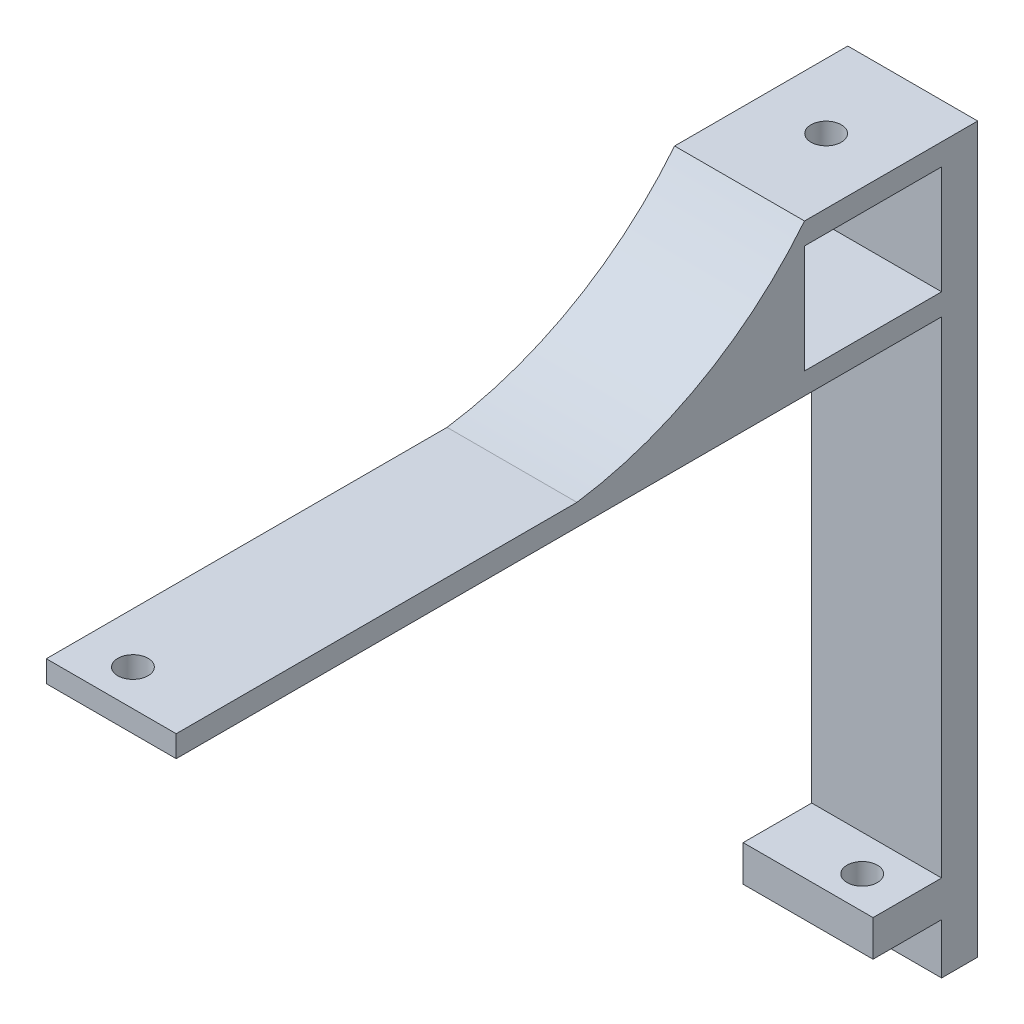
ISO-10303-21;
HEADER;
FILE_DESCRIPTION(('STEP AP214'),'2;1');
FILE_NAME('part.step','',(''),(''),'','','');
FILE_SCHEMA(('AUTOMOTIVE_DESIGN { 1 0 10303 214 1 1 1 1 }'));
ENDSEC;
DATA;
#1=APPLICATION_CONTEXT('core data for automotive mechanical design processes');
#2=APPLICATION_PROTOCOL_DEFINITION('international standard','automotive_design',2000,#1);
#3=PRODUCT_CONTEXT('',#1,'mechanical');
#4=PRODUCT('Part','Part','',(#3));
#5=PRODUCT_RELATED_PRODUCT_CATEGORY('part','',(#4));
#6=PRODUCT_DEFINITION_FORMATION('','',#4);
#7=PRODUCT_DEFINITION_CONTEXT('part definition',#1,'design');
#8=PRODUCT_DEFINITION('design','',#6,#7);
#9=PRODUCT_DEFINITION_SHAPE('','',#8);
#10=(LENGTH_UNIT() NAMED_UNIT(*) SI_UNIT(.MILLI.,.METRE.));
#11=(NAMED_UNIT(*) PLANE_ANGLE_UNIT() SI_UNIT($,.RADIAN.));
#12=(NAMED_UNIT(*) SI_UNIT($,.STERADIAN.) SOLID_ANGLE_UNIT());
#13=UNCERTAINTY_MEASURE_WITH_UNIT(LENGTH_MEASURE(1.E-05),#10,'distance_accuracy_value','');
#14=(GEOMETRIC_REPRESENTATION_CONTEXT(3) GLOBAL_UNCERTAINTY_ASSIGNED_CONTEXT((#13)) GLOBAL_UNIT_ASSIGNED_CONTEXT((#10,
#11,#12)) REPRESENTATION_CONTEXT('',''));
#15=CARTESIAN_POINT('',(0.,0.,0.));
#16=DIRECTION('',(0.,0.,1.));
#17=DIRECTION('',(1.,0.,0.));
#18=AXIS2_PLACEMENT_3D('',#15,#16,#17);
#19=CARTESIAN_POINT('',(52.,192.414352888303,0.));
#20=DIRECTION('',(0.,1.,0.));
#21=DIRECTION('',(0.,0.,1.));
#22=AXIS2_PLACEMENT_3D('',#19,#20,#21);
#23=PLANE('',#22);
#24=DIRECTION('',(1.,0.,0.));
#25=VECTOR('',#24,1.);
#26=CARTESIAN_POINT('',(-24.376584513286,192.414352888303,-32.6395852545773));
#27=LINE('',#26,#25);
#28=CARTESIAN_POINT('',(34.,192.414352888303,-32.6395852545773));
#29=VERTEX_POINT('',#28);
#30=CARTESIAN_POINT('',(52.,192.414352888303,-32.6395852545773));
#31=VERTEX_POINT('',#30);
#32=EDGE_CURVE('E306',#29,#31,#27,.T.);
#33=ORIENTED_EDGE('',*,*,#32,.F.);
#34=DIRECTION('',(0.,0.,-1.));
#35=VECTOR('',#34,1.);
#36=CARTESIAN_POINT('',(34.,192.414352888303,0.));
#37=LINE('',#36,#35);
#38=CARTESIAN_POINT('',(34.,192.414352888303,-13.6395852545773));
#39=VERTEX_POINT('',#38);
#40=EDGE_CURVE('E331',#39,#29,#37,.T.);
#41=ORIENTED_EDGE('',*,*,#40,.F.);
#42=DIRECTION('',(1.,0.,0.));
#43=VECTOR('',#42,1.);
#44=CARTESIAN_POINT('',(-24.376584513286,192.414352888303,-13.6395852545773));
#45=LINE('',#44,#43);
#46=CARTESIAN_POINT('',(52.,192.414352888303,-13.6395852545773));
#47=VERTEX_POINT('',#46);
#48=EDGE_CURVE('E91',#39,#47,#45,.T.);
#49=ORIENTED_EDGE('',*,*,#48,.T.);
#50=DIRECTION('',(0.,0.,-1.));
#51=VECTOR('',#50,1.);
#52=CARTESIAN_POINT('',(52.,192.414352888303,0.));
#53=LINE('',#52,#51);
#54=EDGE_CURVE('E268',#47,#31,#53,.T.);
#55=ORIENTED_EDGE('',*,*,#54,.T.);
#56=EDGE_LOOP('',(#33,#41,#49,#55));
#57=FACE_BOUND('',#56,.T.);
#58=ADVANCED_FACE('F65',(#57),#23,.T.);
#59=CARTESIAN_POINT('',(52.,0.,73.4248216350618));
#60=DIRECTION('',(0.,0.,-1.));
#61=DIRECTION('',(-1.,0.,0.));
#62=AXIS2_PLACEMENT_3D('',#59,#60,#61);
#63=PLANE('',#62);
#64=DIRECTION('',(-1.,0.,0.));
#65=VECTOR('',#64,1.);
#66=CARTESIAN_POINT('',(52.,192.414352888303,73.4248216350618));
#67=LINE('',#66,#65);
#68=CARTESIAN_POINT('',(52.,192.414352888303,73.4248216350618));
#69=VERTEX_POINT('',#68);
#70=CARTESIAN_POINT('',(34.,192.414352888303,73.4248216350618));
#71=VERTEX_POINT('',#70);
#72=EDGE_CURVE('E233',#69,#71,#67,.T.);
#73=ORIENTED_EDGE('',*,*,#72,.T.);
#74=DIRECTION('',(0.,-1.,0.));
#75=VECTOR('',#74,1.);
#76=CARTESIAN_POINT('',(34.,0.,73.4248216350618));
#77=LINE('',#76,#75);
#78=CARTESIAN_POINT('',(34.,189.414352888303,73.4248216350618));
#79=VERTEX_POINT('',#78);
#80=EDGE_CURVE('E228',#71,#79,#77,.T.);
#81=ORIENTED_EDGE('',*,*,#80,.T.);
#82=DIRECTION('',(-1.,0.,0.));
#83=VECTOR('',#82,1.);
#84=CARTESIAN_POINT('',(52.,189.414352888303,73.4248216350618));
#85=LINE('',#84,#83);
#86=CARTESIAN_POINT('',(52.,189.414352888303,73.4248216350618));
#87=VERTEX_POINT('',#86);
#88=EDGE_CURVE('E232',#87,#79,#85,.T.);
#89=ORIENTED_EDGE('',*,*,#88,.F.);
#90=DIRECTION('',(0.,-1.,0.));
#91=VECTOR('',#90,1.);
#92=CARTESIAN_POINT('',(52.,0.,73.4248216350618));
#93=LINE('',#92,#91);
#94=EDGE_CURVE('E223',#69,#87,#93,.T.);
#95=ORIENTED_EDGE('',*,*,#94,.F.);
#96=EDGE_LOOP('',(#73,#81,#89,#95));
#97=FACE_BOUND('',#96,.T.);
#98=ADVANCED_FACE('F67',(#97),#63,.F.);
#99=CARTESIAN_POINT('',(52.,189.414352888303,0.));
#100=DIRECTION('',(0.,1.,0.));
#101=DIRECTION('',(0.,0.,1.));
#102=AXIS2_PLACEMENT_3D('',#99,#100,#101);
#103=PLANE('',#102);
#104=CARTESIAN_POINT('',(41.,189.414352888303,68.4248216350618));
#105=DIRECTION('',(0.,1.,0.));
#106=DIRECTION('',(0.,0.,1.));
#107=AXIS2_PLACEMENT_3D('',#104,#105,#106);
#108=CIRCLE('',#107,2.1);
#109=CARTESIAN_POINT('',(41.,189.414352888303,70.5248216350618));
#110=VERTEX_POINT('',#109);
#111=EDGE_CURVE('E386',#110,#110,#108,.T.);
#112=ORIENTED_EDGE('',*,*,#111,.T.);
#113=EDGE_LOOP('',(#112));
#114=FACE_BOUND('',#113,.T.);
#115=ORIENTED_EDGE('',*,*,#88,.T.);
#116=DIRECTION('',(0.,0.,-1.));
#117=VECTOR('',#116,1.);
#118=CARTESIAN_POINT('',(34.,189.414352888303,0.));
#119=LINE('',#118,#117);
#120=CARTESIAN_POINT('',(34.,189.414352888303,-32.6395852545773));
#121=VERTEX_POINT('',#120);
#122=EDGE_CURVE('E218',#79,#121,#119,.T.);
#123=ORIENTED_EDGE('',*,*,#122,.T.);
#124=DIRECTION('',(-1.,0.,0.));
#125=VECTOR('',#124,1.);
#126=CARTESIAN_POINT('',(52.,189.414352888303,-32.6395852545773));
#127=LINE('',#126,#125);
#128=CARTESIAN_POINT('',(52.,189.414352888303,-32.6395852545773));
#129=VERTEX_POINT('',#128);
#130=EDGE_CURVE('E204',#129,#121,#127,.T.);
#131=ORIENTED_EDGE('',*,*,#130,.F.);
#132=DIRECTION('',(0.,0.,-1.));
#133=VECTOR('',#132,1.);
#134=CARTESIAN_POINT('',(52.,189.414352888303,0.));
#135=LINE('',#134,#133);
#136=EDGE_CURVE('E220',#87,#129,#135,.T.);
#137=ORIENTED_EDGE('',*,*,#136,.F.);
#138=EDGE_LOOP('',(#115,#123,#131,#137));
#139=FACE_BOUND('',#138,.T.);
#140=ADVANCED_FACE('F372',(#114,#139),#103,.F.);
#141=CARTESIAN_POINT('',(52.,0.,-32.6395852545773));
#142=DIRECTION('',(0.,0.,1.));
#143=DIRECTION('',(1.,0.,0.));
#144=AXIS2_PLACEMENT_3D('',#141,#142,#143);
#145=PLANE('',#144);
#146=DIRECTION('',(0.,1.,0.));
#147=VECTOR('',#146,1.);
#148=CARTESIAN_POINT('',(34.,0.,-32.6395852545773));
#149=LINE('',#148,#147);
#150=CARTESIAN_POINT('',(34.,122.064008857799,-32.6395852545773));
#151=VERTEX_POINT('',#150);
#152=EDGE_CURVE('E12',#151,#121,#149,.T.);
#153=ORIENTED_EDGE('',*,*,#152,.F.);
#154=DIRECTION('',(-1.,0.,0.));
#155=VECTOR('',#154,1.);
#156=CARTESIAN_POINT('',(52.,122.064008857799,-32.6395852545773));
#157=LINE('',#156,#155);
#158=CARTESIAN_POINT('',(52.,122.064008857799,-32.6395852545773));
#159=VERTEX_POINT('',#158);
#160=EDGE_CURVE('E203',#159,#151,#157,.T.);
#161=ORIENTED_EDGE('',*,*,#160,.F.);
#162=DIRECTION('',(0.,1.,0.));
#163=VECTOR('',#162,1.);
#164=CARTESIAN_POINT('',(52.,0.,-32.6395852545773));
#165=LINE('',#164,#163);
#166=EDGE_CURVE('E201',#159,#129,#165,.T.);
#167=ORIENTED_EDGE('',*,*,#166,.T.);
#168=ORIENTED_EDGE('',*,*,#130,.T.);
#169=EDGE_LOOP('',(#153,#161,#167,#168));
#170=FACE_BOUND('',#169,.T.);
#171=ADVANCED_FACE('F375',(#170),#145,.T.);
#172=CARTESIAN_POINT('',(52.,122.064008857799,0.));
#173=DIRECTION('',(0.,1.,0.));
#174=DIRECTION('',(0.,0.,1.));
#175=AXIS2_PLACEMENT_3D('',#172,#173,#174);
#176=PLANE('',#175);
#177=CARTESIAN_POINT('',(46.,122.064008857799,-27.6395852545773));
#178=DIRECTION('',(0.,1.,0.));
#179=DIRECTION('',(0.,0.,1.));
#180=AXIS2_PLACEMENT_3D('',#177,#178,#179);
#181=CIRCLE('',#180,2.1);
#182=CARTESIAN_POINT('',(46.,122.064008857799,-25.5395852545773));
#183=VERTEX_POINT('',#182);
#184=EDGE_CURVE('E604',#183,#183,#181,.T.);
#185=ORIENTED_EDGE('',*,*,#184,.F.);
#186=EDGE_LOOP('',(#185));
#187=FACE_BOUND('',#186,.T.);
#188=ORIENTED_EDGE('',*,*,#160,.T.);
#189=DIRECTION('',(0.,0.,-1.));
#190=VECTOR('',#189,1.);
#191=CARTESIAN_POINT('',(34.,122.064008857799,0.));
#192=LINE('',#191,#190);
#193=CARTESIAN_POINT('',(34.,122.064008857799,-23.1395852545773));
#194=VERTEX_POINT('',#193);
#195=EDGE_CURVE('E75',#194,#151,#192,.T.);
#196=ORIENTED_EDGE('',*,*,#195,.F.);
#197=DIRECTION('',(-1.,0.,0.));
#198=VECTOR('',#197,1.);
#199=CARTESIAN_POINT('',(34.,122.064008857799,-23.1395852545773));
#200=LINE('',#199,#198);
#201=CARTESIAN_POINT('',(52.,122.064008857799,-23.1395852545773));
#202=VERTEX_POINT('',#201);
#203=EDGE_CURVE('E83',#202,#194,#200,.T.);
#204=ORIENTED_EDGE('',*,*,#203,.F.);
#205=DIRECTION('',(0.,0.,-1.));
#206=VECTOR('',#205,1.);
#207=CARTESIAN_POINT('',(52.,122.064008857799,0.));
#208=LINE('',#207,#206);
#209=EDGE_CURVE('E192',#202,#159,#208,.T.);
#210=ORIENTED_EDGE('',*,*,#209,.T.);
#211=EDGE_LOOP('',(#188,#196,#204,#210));
#212=FACE_BOUND('',#211,.T.);
#213=ADVANCED_FACE('F191',(#187,#212),#176,.T.);
#214=CARTESIAN_POINT('',(52.,117.064008857799,0.));
#215=DIRECTION('',(0.,1.,0.));
#216=DIRECTION('',(0.,0.,1.));
#217=AXIS2_PLACEMENT_3D('',#214,#215,#216);
#218=PLANE('',#217);
#219=CARTESIAN_POINT('',(46.,117.064008857799,-27.6395852545773));
#220=DIRECTION('',(0.,1.,0.));
#221=DIRECTION('',(0.,0.,1.));
#222=AXIS2_PLACEMENT_3D('',#219,#220,#221);
#223=CIRCLE('',#222,2.1);
#224=CARTESIAN_POINT('',(46.,117.064008857799,-25.5395852545773));
#225=VERTEX_POINT('',#224);
#226=EDGE_CURVE('E69',#225,#225,#223,.T.);
#227=ORIENTED_EDGE('',*,*,#226,.T.);
#228=EDGE_LOOP('',(#227));
#229=FACE_BOUND('',#228,.T.);
#230=DIRECTION('',(0.,0.,-1.));
#231=VECTOR('',#230,1.);
#232=CARTESIAN_POINT('',(34.,117.064008857799,0.));
#233=LINE('',#232,#231);
#234=CARTESIAN_POINT('',(34.,117.064008857799,-23.1395852545773));
#235=VERTEX_POINT('',#234);
#236=CARTESIAN_POINT('',(34.,117.064008857799,-32.6395852545773));
#237=VERTEX_POINT('',#236);
#238=EDGE_CURVE('E208',#235,#237,#233,.T.);
#239=ORIENTED_EDGE('',*,*,#238,.T.);
#240=DIRECTION('',(-1.,0.,0.));
#241=VECTOR('',#240,1.);
#242=CARTESIAN_POINT('',(52.,117.064008857799,-32.6395852545773));
#243=LINE('',#242,#241);
#244=CARTESIAN_POINT('',(52.,117.064008857799,-32.6395852545773));
#245=VERTEX_POINT('',#244);
#246=EDGE_CURVE('E252',#245,#237,#243,.T.);
#247=ORIENTED_EDGE('',*,*,#246,.F.);
#248=DIRECTION('',(0.,0.,-1.));
#249=VECTOR('',#248,1.);
#250=CARTESIAN_POINT('',(52.,117.064008857799,0.));
#251=LINE('',#250,#249);
#252=CARTESIAN_POINT('',(52.,117.064008857799,-23.1395852545773));
#253=VERTEX_POINT('',#252);
#254=EDGE_CURVE('E214',#253,#245,#251,.T.);
#255=ORIENTED_EDGE('',*,*,#254,.F.);
#256=DIRECTION('',(-1.,0.,0.));
#257=VECTOR('',#256,1.);
#258=CARTESIAN_POINT('',(52.,117.064008857799,-23.1395852545773));
#259=LINE('',#258,#257);
#260=EDGE_CURVE('E182',#253,#235,#259,.T.);
#261=ORIENTED_EDGE('',*,*,#260,.T.);
#262=EDGE_LOOP('',(#239,#247,#255,#261));
#263=FACE_BOUND('',#262,.T.);
#264=ADVANCED_FACE('F460',(#229,#263),#218,.F.);
#265=DIRECTION('',(0.,1.,0.));
#266=VECTOR('',#265,1.);
#267=CARTESIAN_POINT('',(34.,0.,-32.6395852545773));
#268=LINE('',#267,#266);
#269=CARTESIAN_POINT('',(34.,110.064008857799,-32.6395852545773));
#270=VERTEX_POINT('',#269);
#271=EDGE_CURVE('E239',#270,#237,#268,.T.);
#272=ORIENTED_EDGE('',*,*,#271,.F.);
#273=DIRECTION('',(-1.,0.,0.));
#274=VECTOR('',#273,1.);
#275=CARTESIAN_POINT('',(52.,110.064008857799,-32.6395852545773));
#276=LINE('',#275,#274);
#277=CARTESIAN_POINT('',(52.,110.064008857799,-32.6395852545773));
#278=VERTEX_POINT('',#277);
#279=EDGE_CURVE('E261',#278,#270,#276,.T.);
#280=ORIENTED_EDGE('',*,*,#279,.F.);
#281=EDGE_CURVE('E219',#278,#245,#165,.T.);
#282=ORIENTED_EDGE('',*,*,#281,.T.);
#283=ORIENTED_EDGE('',*,*,#246,.T.);
#284=EDGE_LOOP('',(#272,#280,#282,#283));
#285=FACE_BOUND('',#284,.T.);
#286=ADVANCED_FACE('F349',(#285),#145,.T.);
#287=CARTESIAN_POINT('',(52.,110.064008857799,0.));
#288=DIRECTION('',(0.,-1.,0.));
#289=DIRECTION('',(0.,0.,-1.));
#290=AXIS2_PLACEMENT_3D('',#287,#288,#289);
#291=PLANE('',#290);
#292=DIRECTION('',(0.,0.,-1.));
#293=VECTOR('',#292,1.);
#294=CARTESIAN_POINT('',(34.,110.064008857799,86.3604147454227));
#295=LINE('',#294,#293);
#296=CARTESIAN_POINT('',(34.,110.064008857799,-37.6395852545773));
#297=VERTEX_POINT('',#296);
#298=EDGE_CURVE('E247',#270,#297,#295,.T.);
#299=ORIENTED_EDGE('',*,*,#298,.T.);
#300=DIRECTION('',(-1.,0.,0.));
#301=VECTOR('',#300,1.);
#302=CARTESIAN_POINT('',(52.,110.064008857799,-37.6395852545773));
#303=LINE('',#302,#301);
#304=CARTESIAN_POINT('',(52.,110.064008857799,-37.6395852545773));
#305=VERTEX_POINT('',#304);
#306=EDGE_CURVE('E265',#305,#297,#303,.T.);
#307=ORIENTED_EDGE('',*,*,#306,.F.);
#308=DIRECTION('',(0.,0.,1.));
#309=VECTOR('',#308,1.);
#310=CARTESIAN_POINT('',(52.,110.064008857799,0.));
#311=LINE('',#310,#309);
#312=EDGE_CURVE('E251',#305,#278,#311,.T.);
#313=ORIENTED_EDGE('',*,*,#312,.T.);
#314=ORIENTED_EDGE('',*,*,#279,.T.);
#315=EDGE_LOOP('',(#299,#307,#313,#314));
#316=FACE_BOUND('',#315,.T.);
#317=ADVANCED_FACE('F341',(#316),#291,.T.);
#318=CARTESIAN_POINT('',(52.,0.,-37.6395852545773));
#319=DIRECTION('',(0.,0.,1.));
#320=DIRECTION('',(1.,0.,0.));
#321=AXIS2_PLACEMENT_3D('',#318,#319,#320);
#322=PLANE('',#321);
#323=ORIENTED_EDGE('',*,*,#306,.T.);
#324=DIRECTION('',(0.,-1.,0.));
#325=VECTOR('',#324,1.);
#326=CARTESIAN_POINT('',(34.,0.,-37.6395852545773));
#327=LINE('',#326,#325);
#328=CARTESIAN_POINT('',(34.,210.414352888303,-37.6395852545773));
#329=VERTEX_POINT('',#328);
#330=EDGE_CURVE('E246',#329,#297,#327,.T.);
#331=ORIENTED_EDGE('',*,*,#330,.F.);
#332=DIRECTION('',(1.,0.,0.));
#333=VECTOR('',#332,1.);
#334=CARTESIAN_POINT('',(-24.376584513286,210.414352888303,-37.6395852545773));
#335=LINE('',#334,#333);
#336=CARTESIAN_POINT('',(52.,210.414352888303,-37.6395852545773));
#337=VERTEX_POINT('',#336);
#338=EDGE_CURVE('E322',#329,#337,#335,.T.);
#339=ORIENTED_EDGE('',*,*,#338,.T.);
#340=DIRECTION('',(0.,1.,0.));
#341=VECTOR('',#340,1.);
#342=CARTESIAN_POINT('',(52.,0.,-37.6395852545773));
#343=LINE('',#342,#341);
#344=EDGE_CURVE('E335',#305,#337,#343,.T.);
#345=ORIENTED_EDGE('',*,*,#344,.F.);
#346=EDGE_LOOP('',(#323,#331,#339,#345));
#347=FACE_BOUND('',#346,.T.);
#348=ADVANCED_FACE('F355',(#347),#322,.F.);
#349=CARTESIAN_POINT('',(41.,192.414352888303,68.4248216350618));
#350=DIRECTION('',(0.,1.,0.));
#351=DIRECTION('',(0.,0.,1.));
#352=AXIS2_PLACEMENT_3D('',#349,#350,#351);
#353=CIRCLE('',#352,2.1);
#354=CARTESIAN_POINT('',(41.,192.414352888303,70.5248216350618));
#355=VERTEX_POINT('',#354);
#356=EDGE_CURVE('E379',#355,#355,#353,.T.);
#357=ORIENTED_EDGE('',*,*,#356,.F.);
#358=EDGE_LOOP('',(#357));
#359=FACE_BOUND('',#358,.T.);
#360=DIRECTION('',(1.,0.,0.));
#361=VECTOR('',#360,1.);
#362=CARTESIAN_POINT('',(-24.376584513286,192.414352888303,17.8926181902422));
#363=LINE('',#362,#361);
#364=CARTESIAN_POINT('',(34.,192.414352888303,17.8926181902422));
#365=VERTEX_POINT('',#364);
#366=CARTESIAN_POINT('',(52.,192.414352888303,17.8926181902422));
#367=VERTEX_POINT('',#366);
#368=EDGE_CURVE('E316',#365,#367,#363,.T.);
#369=ORIENTED_EDGE('',*,*,#368,.F.);
#370=EDGE_CURVE('E255',#71,#365,#37,.T.);
#371=ORIENTED_EDGE('',*,*,#370,.F.);
#372=ORIENTED_EDGE('',*,*,#72,.F.);
#373=EDGE_CURVE('E227',#69,#367,#53,.T.);
#374=ORIENTED_EDGE('',*,*,#373,.T.);
#375=EDGE_LOOP('',(#369,#371,#372,#374));
#376=FACE_BOUND('',#375,.T.);
#377=ADVANCED_FACE('F367',(#359,#376),#23,.T.);
#378=CARTESIAN_POINT('',(52.,0.,0.));
#379=DIRECTION('',(1.,0.,0.));
#380=DIRECTION('',(0.,0.,-1.));
#381=AXIS2_PLACEMENT_3D('',#378,#379,#380);
#382=PLANE('',#381);
#383=DIRECTION('',(0.,1.,0.));
#384=VECTOR('',#383,1.);
#385=CARTESIAN_POINT('',(52.,54.0640088577995,-23.1395852545773));
#386=LINE('',#385,#384);
#387=EDGE_CURVE('E179',#253,#202,#386,.T.);
#388=ORIENTED_EDGE('',*,*,#387,.F.);
#389=ORIENTED_EDGE('',*,*,#254,.T.);
#390=ORIENTED_EDGE('',*,*,#281,.F.);
#391=ORIENTED_EDGE('',*,*,#312,.F.);
#392=ORIENTED_EDGE('',*,*,#344,.T.);
#393=DIRECTION('',(0.,0.,1.));
#394=VECTOR('',#393,1.);
#395=CARTESIAN_POINT('',(52.,210.414352888303,-37.6395852545773));
#396=LINE('',#395,#394);
#397=CARTESIAN_POINT('',(52.,210.414352888303,-13.6395852545773));
#398=VERTEX_POINT('',#397);
#399=EDGE_CURVE('E289',#337,#398,#396,.T.);
#400=ORIENTED_EDGE('',*,*,#399,.T.);
#401=CARTESIAN_POINT('',(52.,241.587789104786,25.0593208042666));
#402=DIRECTION('',(-1.,0.,0.));
#403=DIRECTION('',(0.,0.,1.));
#404=AXIS2_PLACEMENT_3D('',#401,#402,#403);
#405=CIRCLE('',#404,49.6929417090024);
#406=EDGE_CURVE('E294',#398,#367,#405,.T.);
#407=ORIENTED_EDGE('',*,*,#406,.T.);
#408=ORIENTED_EDGE('',*,*,#373,.F.);
#409=ORIENTED_EDGE('',*,*,#94,.T.);
#410=ORIENTED_EDGE('',*,*,#136,.T.);
#411=ORIENTED_EDGE('',*,*,#166,.F.);
#412=ORIENTED_EDGE('',*,*,#209,.F.);
#413=EDGE_LOOP('',(#388,#389,#390,#391,#392,#400,#407,#408,#409,#410,#411,#412));
#414=FACE_BOUND('',#413,.T.);
#415=ORIENTED_EDGE('',*,*,#54,.F.);
#416=DIRECTION('',(0.,1.,0.));
#417=VECTOR('',#416,1.);
#418=CARTESIAN_POINT('',(52.,207.414352888303,-13.6395852545773));
#419=LINE('',#418,#417);
#420=CARTESIAN_POINT('',(52.,207.414352888303,-13.6395852545773));
#421=VERTEX_POINT('',#420);
#422=EDGE_CURVE('E298',#47,#421,#419,.T.);
#423=ORIENTED_EDGE('',*,*,#422,.T.);
#424=DIRECTION('',(0.,0.,-1.));
#425=VECTOR('',#424,1.);
#426=CARTESIAN_POINT('',(52.,207.414352888303,-32.6395852545773));
#427=LINE('',#426,#425);
#428=CARTESIAN_POINT('',(52.,207.414352888303,-32.6395852545773));
#429=VERTEX_POINT('',#428);
#430=EDGE_CURVE('E302',#421,#429,#427,.T.);
#431=ORIENTED_EDGE('',*,*,#430,.T.);
#432=DIRECTION('',(0.,-1.,0.));
#433=VECTOR('',#432,1.);
#434=CARTESIAN_POINT('',(52.,192.414352888303,-32.6395852545773));
#435=LINE('',#434,#433);
#436=EDGE_CURVE('E285',#429,#31,#435,.T.);
#437=ORIENTED_EDGE('',*,*,#436,.T.);
#438=EDGE_LOOP('',(#415,#423,#431,#437));
#439=FACE_BOUND('',#438,.T.);
#440=ADVANCED_FACE('F198',(#414,#439),#382,.T.);
#441=CARTESIAN_POINT('',(34.,0.,86.3604147454227));
#442=DIRECTION('',(1.,0.,0.));
#443=DIRECTION('',(0.,1.,0.));
#444=AXIS2_PLACEMENT_3D('',#441,#442,#443);
#445=PLANE('',#444);
#446=ORIENTED_EDGE('',*,*,#238,.F.);
#447=DIRECTION('',(0.,1.,0.));
#448=VECTOR('',#447,1.);
#449=CARTESIAN_POINT('',(34.,54.0640088577995,-23.1395852545773));
#450=LINE('',#449,#448);
#451=EDGE_CURVE('E187',#235,#194,#450,.T.);
#452=ORIENTED_EDGE('',*,*,#451,.T.);
#453=ORIENTED_EDGE('',*,*,#195,.T.);
#454=ORIENTED_EDGE('',*,*,#152,.T.);
#455=ORIENTED_EDGE('',*,*,#122,.F.);
#456=ORIENTED_EDGE('',*,*,#80,.F.);
#457=ORIENTED_EDGE('',*,*,#370,.T.);
#458=CARTESIAN_POINT('',(34.,241.587789104786,25.0593208042666));
#459=DIRECTION('',(1.,0.,0.));
#460=DIRECTION('',(0.,1.,0.));
#461=AXIS2_PLACEMENT_3D('',#458,#459,#460);
#462=CIRCLE('',#461,49.6929417090024);
#463=CARTESIAN_POINT('',(34.,210.414352888303,-13.6395852545773));
#464=VERTEX_POINT('',#463);
#465=EDGE_CURVE('E399',#365,#464,#462,.T.);
#466=ORIENTED_EDGE('',*,*,#465,.T.);
#467=DIRECTION('',(0.,0.,-1.));
#468=VECTOR('',#467,1.);
#469=CARTESIAN_POINT('',(34.,210.414352888303,-37.6395852545773));
#470=LINE('',#469,#468);
#471=EDGE_CURVE('E310',#464,#329,#470,.T.);
#472=ORIENTED_EDGE('',*,*,#471,.T.);
#473=ORIENTED_EDGE('',*,*,#330,.T.);
#474=ORIENTED_EDGE('',*,*,#298,.F.);
#475=ORIENTED_EDGE('',*,*,#271,.T.);
#476=EDGE_LOOP('',(#446,#452,#453,#454,#455,#456,#457,#466,#472,#473,#474,#475));
#477=FACE_BOUND('',#476,.T.);
#478=DIRECTION('',(0.,-1.,0.));
#479=VECTOR('',#478,1.);
#480=CARTESIAN_POINT('',(34.,207.414352888303,-13.6395852545773));
#481=LINE('',#480,#479);
#482=CARTESIAN_POINT('',(34.,207.414352888303,-13.6395852545773));
#483=VERTEX_POINT('',#482);
#484=EDGE_CURVE('E281',#483,#39,#481,.T.);
#485=ORIENTED_EDGE('',*,*,#484,.T.);
#486=ORIENTED_EDGE('',*,*,#40,.T.);
#487=DIRECTION('',(0.,1.,0.));
#488=VECTOR('',#487,1.);
#489=CARTESIAN_POINT('',(34.,192.414352888303,-32.6395852545773));
#490=LINE('',#489,#488);
#491=CARTESIAN_POINT('',(34.,207.414352888303,-32.6395852545773));
#492=VERTEX_POINT('',#491);
#493=EDGE_CURVE('E271',#29,#492,#490,.T.);
#494=ORIENTED_EDGE('',*,*,#493,.T.);
#495=DIRECTION('',(0.,0.,1.));
#496=VECTOR('',#495,1.);
#497=CARTESIAN_POINT('',(34.,207.414352888303,-32.6395852545773));
#498=LINE('',#497,#496);
#499=EDGE_CURVE('E275',#492,#483,#498,.T.);
#500=ORIENTED_EDGE('',*,*,#499,.T.);
#501=EDGE_LOOP('',(#485,#486,#494,#500));
#502=FACE_BOUND('',#501,.T.);
#503=ADVANCED_FACE('F352',(#477,#502),#445,.F.);
#504=CARTESIAN_POINT('',(-24.376584513286,192.414352888303,-32.6395852545773));
#505=DIRECTION('',(0.,0.,1.));
#506=DIRECTION('',(1.,0.,0.));
#507=AXIS2_PLACEMENT_3D('',#504,#505,#506);
#508=PLANE('',#507);
#509=ORIENTED_EDGE('',*,*,#493,.F.);
#510=ORIENTED_EDGE('',*,*,#32,.T.);
#511=ORIENTED_EDGE('',*,*,#436,.F.);
#512=DIRECTION('',(1.,0.,0.));
#513=VECTOR('',#512,1.);
#514=CARTESIAN_POINT('',(-24.376584513286,207.414352888303,-32.6395852545773));
#515=LINE('',#514,#513);
#516=EDGE_CURVE('E307',#492,#429,#515,.T.);
#517=ORIENTED_EDGE('',*,*,#516,.F.);
#518=EDGE_LOOP('',(#509,#510,#511,#517));
#519=FACE_BOUND('',#518,.T.);
#520=ADVANCED_FACE('F415',(#519),#508,.T.);
#521=CARTESIAN_POINT('',(-24.376584513286,207.414352888303,-32.6395852545773));
#522=DIRECTION('',(0.,-1.,0.));
#523=DIRECTION('',(0.,0.,-1.));
#524=AXIS2_PLACEMENT_3D('',#521,#522,#523);
#525=PLANE('',#524);
#526=CARTESIAN_POINT('',(43.,207.414352888303,-25.6395852545773));
#527=DIRECTION('',(0.,-1.,0.));
#528=DIRECTION('',(0.,0.,-1.));
#529=AXIS2_PLACEMENT_3D('',#526,#527,#528);
#530=CIRCLE('',#529,2.1);
#531=CARTESIAN_POINT('',(43.,207.414352888303,-27.7395852545773));
#532=VERTEX_POINT('',#531);
#533=EDGE_CURVE('E290',#532,#532,#530,.T.);
#534=ORIENTED_EDGE('',*,*,#533,.F.);
#535=EDGE_LOOP('',(#534));
#536=FACE_BOUND('',#535,.T.);
#537=ORIENTED_EDGE('',*,*,#499,.F.);
#538=ORIENTED_EDGE('',*,*,#516,.T.);
#539=ORIENTED_EDGE('',*,*,#430,.F.);
#540=DIRECTION('',(1.,0.,0.));
#541=VECTOR('',#540,1.);
#542=CARTESIAN_POINT('',(-24.376584513286,207.414352888303,-13.6395852545773));
#543=LINE('',#542,#541);
#544=EDGE_CURVE('E311',#483,#421,#543,.T.);
#545=ORIENTED_EDGE('',*,*,#544,.F.);
#546=EDGE_LOOP('',(#537,#538,#539,#545));
#547=FACE_BOUND('',#546,.T.);
#548=ADVANCED_FACE('F417',(#536,#547),#525,.T.);
#549=CARTESIAN_POINT('',(-24.376584513286,207.414352888303,-13.6395852545773));
#550=DIRECTION('',(0.,0.,-1.));
#551=DIRECTION('',(0.,1.,0.));
#552=AXIS2_PLACEMENT_3D('',#549,#550,#551);
#553=PLANE('',#552);
#554=ORIENTED_EDGE('',*,*,#484,.F.);
#555=ORIENTED_EDGE('',*,*,#544,.T.);
#556=ORIENTED_EDGE('',*,*,#422,.F.);
#557=ORIENTED_EDGE('',*,*,#48,.F.);
#558=EDGE_LOOP('',(#554,#555,#556,#557));
#559=FACE_BOUND('',#558,.T.);
#560=ADVANCED_FACE('F418',(#559),#553,.T.);
#561=CARTESIAN_POINT('',(-24.376584513286,241.587789104786,25.0593208042666));
#562=DIRECTION('',(1.,0.,0.));
#563=DIRECTION('',(0.,0.,-1.));
#564=AXIS2_PLACEMENT_3D('',#561,#562,#563);
#565=CYLINDRICAL_SURFACE('',#564,49.6929417090024);
#566=ORIENTED_EDGE('',*,*,#465,.F.);
#567=ORIENTED_EDGE('',*,*,#368,.T.);
#568=ORIENTED_EDGE('',*,*,#406,.F.);
#569=DIRECTION('',(1.,0.,0.));
#570=VECTOR('',#569,1.);
#571=CARTESIAN_POINT('',(-24.376584513286,210.414352888303,-13.6395852545773));
#572=LINE('',#571,#570);
#573=EDGE_CURVE('E319',#464,#398,#572,.T.);
#574=ORIENTED_EDGE('',*,*,#573,.F.);
#575=EDGE_LOOP('',(#566,#567,#568,#574));
#576=FACE_BOUND('',#575,.T.);
#577=ADVANCED_FACE('F420',(#576),#565,.F.);
#578=CARTESIAN_POINT('',(-24.376584513286,210.414352888303,-37.6395852545773));
#579=DIRECTION('',(0.,1.,0.));
#580=DIRECTION('',(0.,0.,1.));
#581=AXIS2_PLACEMENT_3D('',#578,#579,#580);
#582=PLANE('',#581);
#583=CARTESIAN_POINT('',(43.,210.414352888303,-25.6395852545773));
#584=DIRECTION('',(0.,1.,0.));
#585=DIRECTION('',(0.,0.,1.));
#586=AXIS2_PLACEMENT_3D('',#583,#584,#585);
#587=CIRCLE('',#586,2.1);
#588=CARTESIAN_POINT('',(43.,210.414352888303,-23.5395852545773));
#589=VERTEX_POINT('',#588);
#590=EDGE_CURVE('E390',#589,#589,#587,.T.);
#591=ORIENTED_EDGE('',*,*,#590,.F.);
#592=EDGE_LOOP('',(#591));
#593=FACE_BOUND('',#592,.T.);
#594=ORIENTED_EDGE('',*,*,#471,.F.);
#595=ORIENTED_EDGE('',*,*,#573,.T.);
#596=ORIENTED_EDGE('',*,*,#399,.F.);
#597=ORIENTED_EDGE('',*,*,#338,.F.);
#598=EDGE_LOOP('',(#594,#595,#596,#597));
#599=FACE_BOUND('',#598,.T.);
#600=ADVANCED_FACE('F360',(#593,#599),#582,.T.);
#601=CARTESIAN_POINT('',(43.,199.414352888303,-25.6395852545773));
#602=DIRECTION('',(0.,1.,0.));
#603=DIRECTION('',(0.,0.,1.));
#604=AXIS2_PLACEMENT_3D('',#601,#602,#603);
#605=CYLINDRICAL_SURFACE('',#604,2.1);
#606=ORIENTED_EDGE('',*,*,#533,.T.);
#607=EDGE_LOOP('',(#606));
#608=FACE_BOUND('',#607,.T.);
#609=ORIENTED_EDGE('',*,*,#590,.T.);
#610=EDGE_LOOP('',(#609));
#611=FACE_BOUND('',#610,.T.);
#612=ADVANCED_FACE('F448',(#608,#611),#605,.F.);
#613=CARTESIAN_POINT('',(41.,124.414352888303,68.4248216350618));
#614=DIRECTION('',(0.,1.,0.));
#615=DIRECTION('',(0.,0.,1.));
#616=AXIS2_PLACEMENT_3D('',#613,#614,#615);
#617=CYLINDRICAL_SURFACE('',#616,2.1);
#618=ORIENTED_EDGE('',*,*,#356,.T.);
#619=EDGE_LOOP('',(#618));
#620=FACE_BOUND('',#619,.T.);
#621=ORIENTED_EDGE('',*,*,#111,.F.);
#622=EDGE_LOOP('',(#621));
#623=FACE_BOUND('',#622,.T.);
#624=ADVANCED_FACE('F445',(#620,#623),#617,.F.);
#625=CARTESIAN_POINT('',(34.,54.0640088577995,-23.1395852545773));
#626=DIRECTION('',(0.,0.,-1.));
#627=DIRECTION('',(-1.,0.,0.));
#628=AXIS2_PLACEMENT_3D('',#625,#626,#627);
#629=PLANE('',#628);
#630=ORIENTED_EDGE('',*,*,#387,.T.);
#631=ORIENTED_EDGE('',*,*,#203,.T.);
#632=ORIENTED_EDGE('',*,*,#451,.F.);
#633=ORIENTED_EDGE('',*,*,#260,.F.);
#634=EDGE_LOOP('',(#630,#631,#632,#633));
#635=FACE_BOUND('',#634,.T.);
#636=ADVANCED_FACE('F180',(#635),#629,.F.);
#637=CARTESIAN_POINT('',(46.,112.064008857799,-27.6395852545773));
#638=DIRECTION('',(0.,1.,0.));
#639=DIRECTION('',(0.,0.,1.));
#640=AXIS2_PLACEMENT_3D('',#637,#638,#639);
#641=CYLINDRICAL_SURFACE('',#640,2.1);
#642=ORIENTED_EDGE('',*,*,#184,.T.);
#643=EDGE_LOOP('',(#642));
#644=FACE_BOUND('',#643,.T.);
#645=ORIENTED_EDGE('',*,*,#226,.F.);
#646=EDGE_LOOP('',(#645));
#647=FACE_BOUND('',#646,.T.);
#648=ADVANCED_FACE('F563',(#644,#647),#641,.F.);
#649=CLOSED_SHELL('',(#58,#98,#140,#171,#213,#264,#286,#317,#348,#377,#440,#503,#520,#548,#560,
#577,#600,#612,#624,#636,#648));
#650=MANIFOLD_SOLID_BREP('B2',#649);
#651=ADVANCED_BREP_SHAPE_REPRESENTATION('',(#18,#650),#14);
#652=SHAPE_DEFINITION_REPRESENTATION(#9,#651);
ENDSEC;
END-ISO-10303-21;
